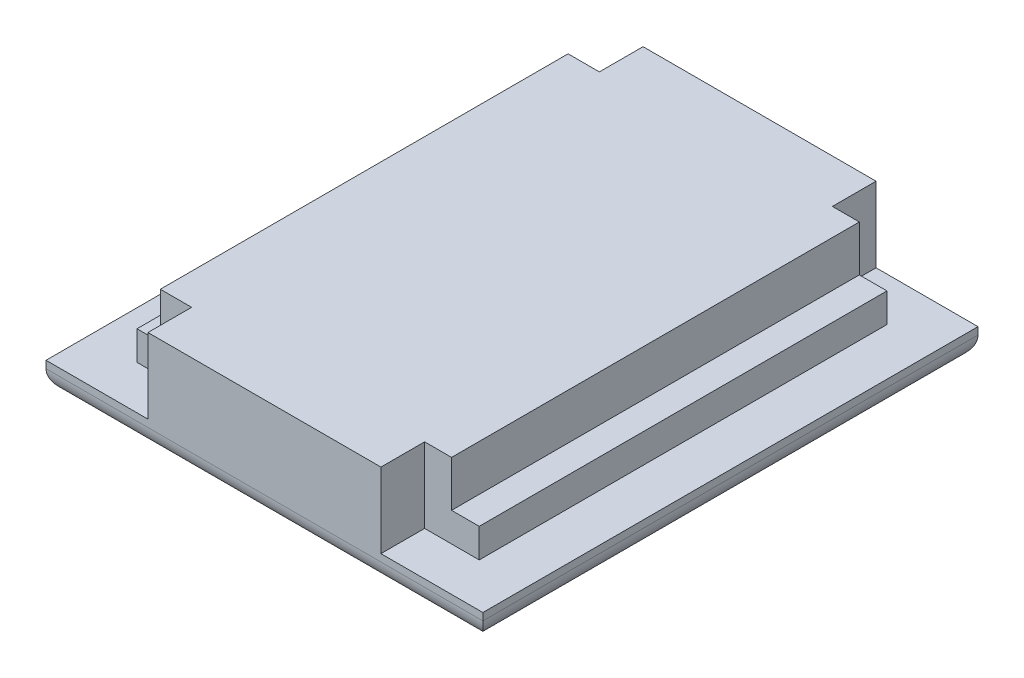
ISO-10303-21;
HEADER;
FILE_DESCRIPTION(('STEP AP214'),'2;1');
FILE_NAME('part.step','',(''),(''),'','','');
FILE_SCHEMA(('AUTOMOTIVE_DESIGN { 1 0 10303 214 1 1 1 1 }'));
ENDSEC;
DATA;
#1=APPLICATION_CONTEXT('core data for automotive mechanical design processes');
#2=APPLICATION_PROTOCOL_DEFINITION('international standard','automotive_design',2000,#1);
#3=PRODUCT_CONTEXT('',#1,'mechanical');
#4=PRODUCT('Part','Part','',(#3));
#5=PRODUCT_RELATED_PRODUCT_CATEGORY('part','',(#4));
#6=PRODUCT_DEFINITION_FORMATION('','',#4);
#7=PRODUCT_DEFINITION_CONTEXT('part definition',#1,'design');
#8=PRODUCT_DEFINITION('design','',#6,#7);
#9=PRODUCT_DEFINITION_SHAPE('','',#8);
#10=(LENGTH_UNIT() NAMED_UNIT(*) SI_UNIT(.MILLI.,.METRE.));
#11=(NAMED_UNIT(*) PLANE_ANGLE_UNIT() SI_UNIT($,.RADIAN.));
#12=(NAMED_UNIT(*) SI_UNIT($,.STERADIAN.) SOLID_ANGLE_UNIT());
#13=UNCERTAINTY_MEASURE_WITH_UNIT(LENGTH_MEASURE(1.E-05),#10,'distance_accuracy_value','');
#14=(GEOMETRIC_REPRESENTATION_CONTEXT(3) GLOBAL_UNCERTAINTY_ASSIGNED_CONTEXT((#13)) GLOBAL_UNIT_ASSIGNED_CONTEXT((#10,
#11,#12)) REPRESENTATION_CONTEXT('',''));
#15=CARTESIAN_POINT('',(0.,0.,0.));
#16=DIRECTION('',(0.,0.,1.));
#17=DIRECTION('',(1.,0.,0.));
#18=AXIS2_PLACEMENT_3D('',#15,#16,#17);
#19=CARTESIAN_POINT('',(0.,2.54,0.));
#20=DIRECTION('',(0.,1.,0.));
#21=DIRECTION('',(0.,0.,1.));
#22=AXIS2_PLACEMENT_3D('',#19,#20,#21);
#23=PLANE('',#22);
#24=DIRECTION('',(-1.,0.,0.));
#25=VECTOR('',#24,1.);
#26=CARTESIAN_POINT('',(-15.1389772727273,2.54,-7.48289772727273));
#27=LINE('',#26,#25);
#28=CARTESIAN_POINT('',(-10.3764772727273,2.54,-7.48289772727273));
#29=VERTEX_POINT('',#28);
#30=CARTESIAN_POINT('',(-15.1389772727273,2.54,-7.48289772727273));
#31=VERTEX_POINT('',#30);
#32=EDGE_CURVE('E298',#29,#31,#27,.T.);
#33=ORIENTED_EDGE('',*,*,#32,.F.);
#34=DIRECTION('',(0.,0.,1.));
#35=VECTOR('',#34,1.);
#36=CARTESIAN_POINT('',(-10.3764772727273,2.54,-11.2928977272727));
#37=LINE('',#36,#35);
#38=CARTESIAN_POINT('',(-10.3764772727273,2.54,-11.2928977272727));
#39=VERTEX_POINT('',#38);
#40=EDGE_CURVE('E219',#39,#29,#37,.T.);
#41=ORIENTED_EDGE('',*,*,#40,.F.);
#42=DIRECTION('',(-1.,0.,0.));
#43=VECTOR('',#42,1.);
#44=CARTESIAN_POINT('',(-19.2664772727273,2.54,-11.2928977272727));
#45=LINE('',#44,#43);
#46=CARTESIAN_POINT('',(-19.2664772727273,2.54,-11.2928977272727));
#47=VERTEX_POINT('',#46);
#48=EDGE_CURVE('E321',#39,#47,#45,.T.);
#49=ORIENTED_EDGE('',*,*,#48,.T.);
#50=DIRECTION('',(0.,0.,1.));
#51=VECTOR('',#50,1.);
#52=CARTESIAN_POINT('',(-19.2664772727273,2.54,-11.2928977272727));
#53=LINE('',#52,#51);
#54=CARTESIAN_POINT('',(-19.2664772727273,2.54,31.8871022727273));
#55=VERTEX_POINT('',#54);
#56=EDGE_CURVE('E312',#47,#55,#53,.T.);
#57=ORIENTED_EDGE('',*,*,#56,.T.);
#58=DIRECTION('',(1.,0.,0.));
#59=VECTOR('',#58,1.);
#60=CARTESIAN_POINT('',(-19.2664772727273,2.54,31.8871022727273));
#61=LINE('',#60,#59);
#62=CARTESIAN_POINT('',(-10.3764772727273,2.54,31.8871022727273));
#63=VERTEX_POINT('',#62);
#64=EDGE_CURVE('E316',#55,#63,#61,.T.);
#65=ORIENTED_EDGE('',*,*,#64,.T.);
#66=DIRECTION('',(0.,0.,1.));
#67=VECTOR('',#66,1.);
#68=CARTESIAN_POINT('',(-10.3764772727273,2.54,28.0771022727273));
#69=LINE('',#68,#67);
#70=CARTESIAN_POINT('',(-10.3764772727273,2.54,28.0771022727273));
#71=VERTEX_POINT('',#70);
#72=EDGE_CURVE('E215',#71,#63,#69,.T.);
#73=ORIENTED_EDGE('',*,*,#72,.F.);
#74=DIRECTION('',(1.,0.,0.));
#75=VECTOR('',#74,1.);
#76=CARTESIAN_POINT('',(-15.1389772727273,2.54,28.0771022727273));
#77=LINE('',#76,#75);
#78=CARTESIAN_POINT('',(-15.1389772727273,2.54,28.0771022727273));
#79=VERTEX_POINT('',#78);
#80=EDGE_CURVE('E292',#79,#71,#77,.T.);
#81=ORIENTED_EDGE('',*,*,#80,.F.);
#82=DIRECTION('',(0.,0.,1.));
#83=VECTOR('',#82,1.);
#84=CARTESIAN_POINT('',(-15.1389772727273,2.54,-7.48289772727273));
#85=LINE('',#84,#83);
#86=EDGE_CURVE('E275',#31,#79,#85,.T.);
#87=ORIENTED_EDGE('',*,*,#86,.F.);
#88=EDGE_LOOP('',(#33,#41,#49,#57,#65,#73,#81,#87));
#89=FACE_BOUND('',#88,.T.);
#90=ADVANCED_FACE('F37',(#89),#23,.T.);
#91=CARTESIAN_POINT('',(18.8335227272727,2.54,-11.2928977272727));
#92=VERTEX_POINT('',#91);
#93=CARTESIAN_POINT('',(9.94352272727273,2.54,-11.2928977272727));
#94=VERTEX_POINT('',#93);
#95=EDGE_CURVE('E322',#92,#94,#45,.T.);
#96=ORIENTED_EDGE('',*,*,#95,.T.);
#97=DIRECTION('',(0.,0.,-1.));
#98=VECTOR('',#97,1.);
#99=CARTESIAN_POINT('',(9.94352272727273,2.54,-11.2928977272727));
#100=LINE('',#99,#98);
#101=CARTESIAN_POINT('',(9.94352272727273,2.54,-7.48289772727273));
#102=VERTEX_POINT('',#101);
#103=EDGE_CURVE('E195',#102,#94,#100,.T.);
#104=ORIENTED_EDGE('',*,*,#103,.F.);
#105=CARTESIAN_POINT('',(14.7060227272727,2.54,-7.48289772727273));
#106=VERTEX_POINT('',#105);
#107=EDGE_CURVE('E280',#106,#102,#27,.T.);
#108=ORIENTED_EDGE('',*,*,#107,.F.);
#109=DIRECTION('',(0.,0.,-1.));
#110=VECTOR('',#109,1.);
#111=CARTESIAN_POINT('',(14.7060227272727,2.54,-7.48289772727273));
#112=LINE('',#111,#110);
#113=CARTESIAN_POINT('',(14.7060227272727,2.54,28.0771022727273));
#114=VERTEX_POINT('',#113);
#115=EDGE_CURVE('E295',#114,#106,#112,.T.);
#116=ORIENTED_EDGE('',*,*,#115,.F.);
#117=CARTESIAN_POINT('',(9.94352272727273,2.54,28.0771022727272));
#118=VERTEX_POINT('',#117);
#119=EDGE_CURVE('E291',#118,#114,#77,.T.);
#120=ORIENTED_EDGE('',*,*,#119,.F.);
#121=DIRECTION('',(0.,0.,-1.));
#122=VECTOR('',#121,1.);
#123=CARTESIAN_POINT('',(9.94352272727273,2.54,28.0771022727272));
#124=LINE('',#123,#122);
#125=CARTESIAN_POINT('',(9.94352272727273,2.54,31.8871022727273));
#126=VERTEX_POINT('',#125);
#127=EDGE_CURVE('E228',#126,#118,#124,.T.);
#128=ORIENTED_EDGE('',*,*,#127,.F.);
#129=CARTESIAN_POINT('',(18.8335227272727,2.54,31.8871022727273));
#130=VERTEX_POINT('',#129);
#131=EDGE_CURVE('E315',#126,#130,#61,.T.);
#132=ORIENTED_EDGE('',*,*,#131,.T.);
#133=DIRECTION('',(0.,0.,-1.));
#134=VECTOR('',#133,1.);
#135=CARTESIAN_POINT('',(18.8335227272727,2.54,-11.2928977272727));
#136=LINE('',#135,#134);
#137=EDGE_CURVE('E319',#130,#92,#136,.T.);
#138=ORIENTED_EDGE('',*,*,#137,.T.);
#139=EDGE_LOOP('',(#96,#104,#108,#116,#120,#128,#132,#138));
#140=FACE_BOUND('',#139,.T.);
#141=ADVANCED_FACE('F380',(#140),#23,.T.);
#142=CARTESIAN_POINT('',(-15.1389772727273,5.08,-7.48289772727273));
#143=DIRECTION('',(0.,0.,1.));
#144=DIRECTION('',(1.,0.,0.));
#145=AXIS2_PLACEMENT_3D('',#142,#143,#144);
#146=PLANE('',#145);
#147=DIRECTION('',(0.,-1.,0.));
#148=VECTOR('',#147,1.);
#149=CARTESIAN_POINT('',(-10.3764772727273,29.7541021570466,-7.48289772727273));
#150=LINE('',#149,#148);
#151=CARTESIAN_POINT('',(-10.3764772727273,9.08,-7.48289772727273));
#152=VERTEX_POINT('',#151);
#153=EDGE_CURVE('E222',#152,#29,#150,.T.);
#154=ORIENTED_EDGE('',*,*,#153,.T.);
#155=ORIENTED_EDGE('',*,*,#32,.T.);
#156=DIRECTION('',(0.,-1.,0.));
#157=VECTOR('',#156,1.);
#158=CARTESIAN_POINT('',(-15.1389772727273,5.08,-7.48289772727273));
#159=LINE('',#158,#157);
#160=CARTESIAN_POINT('',(-15.1389772727273,5.08,-7.48289772727273));
#161=VERTEX_POINT('',#160);
#162=EDGE_CURVE('E288',#161,#31,#159,.T.);
#163=ORIENTED_EDGE('',*,*,#162,.F.);
#164=DIRECTION('',(-1.,0.,0.));
#165=VECTOR('',#164,1.);
#166=CARTESIAN_POINT('',(-15.1389772727273,5.08,-7.48289772727273));
#167=LINE('',#166,#165);
#168=CARTESIAN_POINT('',(-13.1069772727273,5.08,-7.48289772727273));
#169=VERTEX_POINT('',#168);
#170=EDGE_CURVE('E285',#169,#161,#167,.T.);
#171=ORIENTED_EDGE('',*,*,#170,.F.);
#172=DIRECTION('',(0.,-1.,0.));
#173=VECTOR('',#172,1.);
#174=CARTESIAN_POINT('',(-13.1069772727273,9.08,-7.48289772727273));
#175=LINE('',#174,#173);
#176=CARTESIAN_POINT('',(-13.1069772727273,9.08,-7.48289772727273));
#177=VERTEX_POINT('',#176);
#178=EDGE_CURVE('E259',#177,#169,#175,.T.);
#179=ORIENTED_EDGE('',*,*,#178,.F.);
#180=DIRECTION('',(-1.,0.,0.));
#181=VECTOR('',#180,1.);
#182=CARTESIAN_POINT('',(-13.1069772727273,9.08,-7.48289772727273));
#183=LINE('',#182,#181);
#184=EDGE_CURVE('E257',#152,#177,#183,.T.);
#185=ORIENTED_EDGE('',*,*,#184,.F.);
#186=EDGE_LOOP('',(#154,#155,#163,#171,#179,#185));
#187=FACE_BOUND('',#186,.T.);
#188=ADVANCED_FACE('F419',(#187),#146,.F.);
#189=DIRECTION('',(0.,-1.,0.));
#190=VECTOR('',#189,1.);
#191=CARTESIAN_POINT('',(9.94352272727273,29.7541021570466,-7.48289772727273));
#192=LINE('',#191,#190);
#193=CARTESIAN_POINT('',(9.94352272727273,9.08,-7.48289772727273));
#194=VERTEX_POINT('',#193);
#195=EDGE_CURVE('E225',#194,#102,#192,.T.);
#196=ORIENTED_EDGE('',*,*,#195,.F.);
#197=CARTESIAN_POINT('',(12.2930227272727,9.08,-7.48289772727273));
#198=VERTEX_POINT('',#197);
#199=EDGE_CURVE('E212',#198,#194,#183,.T.);
#200=ORIENTED_EDGE('',*,*,#199,.F.);
#201=DIRECTION('',(0.,-1.,0.));
#202=VECTOR('',#201,1.);
#203=CARTESIAN_POINT('',(12.2930227272727,9.08,-7.48289772727273));
#204=LINE('',#203,#202);
#205=CARTESIAN_POINT('',(12.2930227272727,5.08,-7.48289772727273));
#206=VERTEX_POINT('',#205);
#207=EDGE_CURVE('E266',#198,#206,#204,.T.);
#208=ORIENTED_EDGE('',*,*,#207,.T.);
#209=CARTESIAN_POINT('',(14.7060227272727,5.08,-7.48289772727273));
#210=VERTEX_POINT('',#209);
#211=EDGE_CURVE('E286',#210,#206,#167,.T.);
#212=ORIENTED_EDGE('',*,*,#211,.F.);
#213=DIRECTION('',(0.,-1.,0.));
#214=VECTOR('',#213,1.);
#215=CARTESIAN_POINT('',(14.7060227272727,5.08,-7.48289772727273));
#216=LINE('',#215,#214);
#217=EDGE_CURVE('E303',#210,#106,#216,.T.);
#218=ORIENTED_EDGE('',*,*,#217,.T.);
#219=ORIENTED_EDGE('',*,*,#107,.T.);
#220=EDGE_LOOP('',(#196,#200,#208,#212,#218,#219));
#221=FACE_BOUND('',#220,.T.);
#222=ADVANCED_FACE('F588',(#221),#146,.F.);
#223=CARTESIAN_POINT('',(-15.1389772727273,5.08,28.0771022727273));
#224=DIRECTION('',(0.,0.,-1.));
#225=DIRECTION('',(-1.,0.,0.));
#226=AXIS2_PLACEMENT_3D('',#223,#224,#225);
#227=PLANE('',#226);
#228=DIRECTION('',(0.,-1.,0.));
#229=VECTOR('',#228,1.);
#230=CARTESIAN_POINT('',(-10.3764772727273,29.7541021570466,28.0771022727273));
#231=LINE('',#230,#229);
#232=CARTESIAN_POINT('',(-10.3764772727273,9.08,28.0771022727273));
#233=VERTEX_POINT('',#232);
#234=EDGE_CURVE('E213',#233,#71,#231,.T.);
#235=ORIENTED_EDGE('',*,*,#234,.F.);
#236=DIRECTION('',(1.,0.,0.));
#237=VECTOR('',#236,1.);
#238=CARTESIAN_POINT('',(-13.1069772727273,9.08,28.0771022727273));
#239=LINE('',#238,#237);
#240=CARTESIAN_POINT('',(-13.1069772727273,9.08,28.0771022727273));
#241=VERTEX_POINT('',#240);
#242=EDGE_CURVE('E252',#241,#233,#239,.T.);
#243=ORIENTED_EDGE('',*,*,#242,.F.);
#244=DIRECTION('',(0.,-1.,0.));
#245=VECTOR('',#244,1.);
#246=CARTESIAN_POINT('',(-13.1069772727273,9.08,28.0771022727273));
#247=LINE('',#246,#245);
#248=CARTESIAN_POINT('',(-13.1069772727273,5.08,28.0771022727273));
#249=VERTEX_POINT('',#248);
#250=EDGE_CURVE('E272',#241,#249,#247,.T.);
#251=ORIENTED_EDGE('',*,*,#250,.T.);
#252=DIRECTION('',(1.,0.,0.));
#253=VECTOR('',#252,1.);
#254=CARTESIAN_POINT('',(-15.1389772727273,5.08,28.0771022727273));
#255=LINE('',#254,#253);
#256=CARTESIAN_POINT('',(-15.1389772727273,5.08,28.0771022727273));
#257=VERTEX_POINT('',#256);
#258=EDGE_CURVE('E281',#257,#249,#255,.T.);
#259=ORIENTED_EDGE('',*,*,#258,.F.);
#260=DIRECTION('',(0.,-1.,0.));
#261=VECTOR('',#260,1.);
#262=CARTESIAN_POINT('',(-15.1389772727273,5.08,28.0771022727273));
#263=LINE('',#262,#261);
#264=EDGE_CURVE('E309',#257,#79,#263,.T.);
#265=ORIENTED_EDGE('',*,*,#264,.T.);
#266=ORIENTED_EDGE('',*,*,#80,.T.);
#267=EDGE_LOOP('',(#235,#243,#251,#259,#265,#266));
#268=FACE_BOUND('',#267,.T.);
#269=ADVANCED_FACE('F392',(#268),#227,.F.);
#270=DIRECTION('',(0.,-1.,0.));
#271=VECTOR('',#270,1.);
#272=CARTESIAN_POINT('',(9.94352272727273,29.7541021570466,28.0771022727272));
#273=LINE('',#272,#271);
#274=CARTESIAN_POINT('',(9.94352272727273,9.08,28.0771022727273));
#275=VERTEX_POINT('',#274);
#276=EDGE_CURVE('E230',#275,#118,#273,.T.);
#277=ORIENTED_EDGE('',*,*,#276,.T.);
#278=ORIENTED_EDGE('',*,*,#119,.T.);
#279=DIRECTION('',(0.,-1.,0.));
#280=VECTOR('',#279,1.);
#281=CARTESIAN_POINT('',(14.7060227272727,5.08,28.0771022727273));
#282=LINE('',#281,#280);
#283=CARTESIAN_POINT('',(14.7060227272727,5.08,28.0771022727273));
#284=VERTEX_POINT('',#283);
#285=EDGE_CURVE('E306',#284,#114,#282,.T.);
#286=ORIENTED_EDGE('',*,*,#285,.F.);
#287=CARTESIAN_POINT('',(12.2930227272727,5.08,28.0771022727273));
#288=VERTEX_POINT('',#287);
#289=EDGE_CURVE('E279',#288,#284,#255,.T.);
#290=ORIENTED_EDGE('',*,*,#289,.F.);
#291=DIRECTION('',(0.,-1.,0.));
#292=VECTOR('',#291,1.);
#293=CARTESIAN_POINT('',(12.2930227272727,9.08,28.0771022727273));
#294=LINE('',#293,#292);
#295=CARTESIAN_POINT('',(12.2930227272727,9.08,28.0771022727273));
#296=VERTEX_POINT('',#295);
#297=EDGE_CURVE('E269',#296,#288,#294,.T.);
#298=ORIENTED_EDGE('',*,*,#297,.F.);
#299=EDGE_CURVE('E250',#275,#296,#239,.T.);
#300=ORIENTED_EDGE('',*,*,#299,.F.);
#301=EDGE_LOOP('',(#277,#278,#286,#290,#298,#300));
#302=FACE_BOUND('',#301,.T.);
#303=ADVANCED_FACE('F409',(#302),#227,.F.);
#304=CARTESIAN_POINT('',(0.,5.08,0.));
#305=DIRECTION('',(0.,1.,0.));
#306=DIRECTION('',(0.,0.,1.));
#307=AXIS2_PLACEMENT_3D('',#304,#305,#306);
#308=PLANE('',#307);
#309=DIRECTION('',(0.,0.,1.));
#310=VECTOR('',#309,1.);
#311=CARTESIAN_POINT('',(-13.1069772727273,5.08,-7.48289772727273));
#312=LINE('',#311,#310);
#313=EDGE_CURVE('E237',#169,#249,#312,.T.);
#314=ORIENTED_EDGE('',*,*,#313,.F.);
#315=ORIENTED_EDGE('',*,*,#170,.T.);
#316=DIRECTION('',(0.,0.,1.));
#317=VECTOR('',#316,1.);
#318=CARTESIAN_POINT('',(-15.1389772727273,5.08,-7.48289772727273));
#319=LINE('',#318,#317);
#320=EDGE_CURVE('E276',#161,#257,#319,.T.);
#321=ORIENTED_EDGE('',*,*,#320,.T.);
#322=ORIENTED_EDGE('',*,*,#258,.T.);
#323=EDGE_LOOP('',(#314,#315,#321,#322));
#324=FACE_BOUND('',#323,.T.);
#325=ADVANCED_FACE('F402',(#324),#308,.T.);
#326=CARTESIAN_POINT('',(-19.2664772727273,2.54,-11.2928977272727));
#327=DIRECTION('',(1.,0.,0.));
#328=DIRECTION('',(0.,0.,-1.));
#329=AXIS2_PLACEMENT_3D('',#326,#327,#328);
#330=PLANE('',#329);
#331=DIRECTION('',(0.,-1.,0.));
#332=VECTOR('',#331,1.);
#333=CARTESIAN_POINT('',(-19.2664772727273,2.54,-11.2928977272727));
#334=LINE('',#333,#332);
#335=CARTESIAN_POINT('',(-19.2664772727273,1.905,-11.2928977272727));
#336=VERTEX_POINT('',#335);
#337=EDGE_CURVE('E324',#47,#336,#334,.T.);
#338=ORIENTED_EDGE('',*,*,#337,.T.);
#339=DIRECTION('',(0.,0.,1.));
#340=VECTOR('',#339,1.);
#341=CARTESIAN_POINT('',(-19.2664772727273,1.905,-11.2928977272727));
#342=LINE('',#341,#340);
#343=CARTESIAN_POINT('',(-19.2664772727273,1.905,31.8871022727273));
#344=VERTEX_POINT('',#343);
#345=EDGE_CURVE('E11',#336,#344,#342,.T.);
#346=ORIENTED_EDGE('',*,*,#345,.T.);
#347=DIRECTION('',(0.,-1.,0.));
#348=VECTOR('',#347,1.);
#349=CARTESIAN_POINT('',(-19.2664772727273,2.54,31.8871022727273));
#350=LINE('',#349,#348);
#351=EDGE_CURVE('E330',#55,#344,#350,.T.);
#352=ORIENTED_EDGE('',*,*,#351,.F.);
#353=ORIENTED_EDGE('',*,*,#56,.F.);
#354=EDGE_LOOP('',(#338,#346,#352,#353));
#355=FACE_BOUND('',#354,.T.);
#356=ADVANCED_FACE('F400',(#355),#330,.F.);
#357=CARTESIAN_POINT('',(-19.2664772727273,2.54,31.8871022727273));
#358=DIRECTION('',(0.,0.,-1.));
#359=DIRECTION('',(-1.,0.,0.));
#360=AXIS2_PLACEMENT_3D('',#357,#358,#359);
#361=PLANE('',#360);
#362=ORIENTED_EDGE('',*,*,#351,.T.);
#363=DIRECTION('',(1.,0.,0.));
#364=VECTOR('',#363,1.);
#365=CARTESIAN_POINT('',(-19.2664772727273,1.905,31.8871022727273));
#366=LINE('',#365,#364);
#367=CARTESIAN_POINT('',(18.8335227272727,1.905,31.8871022727273));
#368=VERTEX_POINT('',#367);
#369=EDGE_CURVE('E333',#344,#368,#366,.T.);
#370=ORIENTED_EDGE('',*,*,#369,.T.);
#371=DIRECTION('',(0.,-1.,0.));
#372=VECTOR('',#371,1.);
#373=CARTESIAN_POINT('',(18.8335227272727,2.54,31.8871022727273));
#374=LINE('',#373,#372);
#375=EDGE_CURVE('E328',#130,#368,#374,.T.);
#376=ORIENTED_EDGE('',*,*,#375,.F.);
#377=ORIENTED_EDGE('',*,*,#131,.F.);
#378=DIRECTION('',(0.,-1.,0.));
#379=VECTOR('',#378,1.);
#380=CARTESIAN_POINT('',(9.94352272727273,29.7541021570466,31.8871022727273));
#381=LINE('',#380,#379);
#382=CARTESIAN_POINT('',(9.94352272727273,9.08,31.8871022727273));
#383=VERTEX_POINT('',#382);
#384=EDGE_CURVE('E231',#383,#126,#381,.T.);
#385=ORIENTED_EDGE('',*,*,#384,.F.);
#386=DIRECTION('',(1.,0.,0.));
#387=VECTOR('',#386,1.);
#388=CARTESIAN_POINT('',(-10.3764772727273,9.08,31.8871022727273));
#389=LINE('',#388,#387);
#390=CARTESIAN_POINT('',(-10.3764772727273,9.08,31.8871022727273));
#391=VERTEX_POINT('',#390);
#392=EDGE_CURVE('E238',#391,#383,#389,.T.);
#393=ORIENTED_EDGE('',*,*,#392,.F.);
#394=DIRECTION('',(0.,-1.,0.));
#395=VECTOR('',#394,1.);
#396=CARTESIAN_POINT('',(-10.3764772727273,29.7541021570466,31.8871022727273));
#397=LINE('',#396,#395);
#398=EDGE_CURVE('E234',#391,#63,#397,.T.);
#399=ORIENTED_EDGE('',*,*,#398,.T.);
#400=ORIENTED_EDGE('',*,*,#64,.F.);
#401=EDGE_LOOP('',(#362,#370,#376,#377,#385,#393,#399,#400));
#402=FACE_BOUND('',#401,.T.);
#403=ADVANCED_FACE('F374',(#402),#361,.F.);
#404=CARTESIAN_POINT('',(18.8335227272727,2.54,-11.2928977272727));
#405=DIRECTION('',(-1.,0.,0.));
#406=DIRECTION('',(0.,0.,1.));
#407=AXIS2_PLACEMENT_3D('',#404,#405,#406);
#408=PLANE('',#407);
#409=ORIENTED_EDGE('',*,*,#375,.T.);
#410=DIRECTION('',(0.,0.,-1.));
#411=VECTOR('',#410,1.);
#412=CARTESIAN_POINT('',(18.8335227272727,1.905,-11.2928977272727));
#413=LINE('',#412,#411);
#414=CARTESIAN_POINT('',(18.8335227272727,1.905,-11.2928977272727));
#415=VERTEX_POINT('',#414);
#416=EDGE_CURVE('E61',#368,#415,#413,.T.);
#417=ORIENTED_EDGE('',*,*,#416,.T.);
#418=DIRECTION('',(0.,-1.,0.));
#419=VECTOR('',#418,1.);
#420=CARTESIAN_POINT('',(18.8335227272727,2.54,-11.2928977272727));
#421=LINE('',#420,#419);
#422=EDGE_CURVE('E326',#92,#415,#421,.T.);
#423=ORIENTED_EDGE('',*,*,#422,.F.);
#424=ORIENTED_EDGE('',*,*,#137,.F.);
#425=EDGE_LOOP('',(#409,#417,#423,#424));
#426=FACE_BOUND('',#425,.T.);
#427=ADVANCED_FACE('F378',(#426),#408,.F.);
#428=CARTESIAN_POINT('',(-19.2664772727273,2.54,-11.2928977272727));
#429=DIRECTION('',(0.,0.,1.));
#430=DIRECTION('',(1.,0.,0.));
#431=AXIS2_PLACEMENT_3D('',#428,#429,#430);
#432=PLANE('',#431);
#433=ORIENTED_EDGE('',*,*,#422,.T.);
#434=DIRECTION('',(-1.,0.,0.));
#435=VECTOR('',#434,1.);
#436=CARTESIAN_POINT('',(-19.2664772727273,1.905,-11.2928977272727));
#437=LINE('',#436,#435);
#438=EDGE_CURVE('E46',#415,#336,#437,.T.);
#439=ORIENTED_EDGE('',*,*,#438,.T.);
#440=ORIENTED_EDGE('',*,*,#337,.F.);
#441=ORIENTED_EDGE('',*,*,#48,.F.);
#442=DIRECTION('',(0.,-1.,0.));
#443=VECTOR('',#442,1.);
#444=CARTESIAN_POINT('',(-10.3764772727273,29.7541021570466,-11.2928977272727));
#445=LINE('',#444,#443);
#446=CARTESIAN_POINT('',(-10.3764772727273,9.08,-11.2928977272727));
#447=VERTEX_POINT('',#446);
#448=EDGE_CURVE('E203',#447,#39,#445,.T.);
#449=ORIENTED_EDGE('',*,*,#448,.F.);
#450=DIRECTION('',(-1.,0.,0.));
#451=VECTOR('',#450,1.);
#452=CARTESIAN_POINT('',(-10.3764772727273,9.08,-11.2928977272727));
#453=LINE('',#452,#451);
#454=CARTESIAN_POINT('',(9.94352272727273,9.08,-11.2928977272727));
#455=VERTEX_POINT('',#454);
#456=EDGE_CURVE('E198',#455,#447,#453,.T.);
#457=ORIENTED_EDGE('',*,*,#456,.F.);
#458=DIRECTION('',(0.,-1.,0.));
#459=VECTOR('',#458,1.);
#460=CARTESIAN_POINT('',(9.94352272727273,29.7541021570466,-11.2928977272727));
#461=LINE('',#460,#459);
#462=EDGE_CURVE('E188',#455,#94,#461,.T.);
#463=ORIENTED_EDGE('',*,*,#462,.T.);
#464=ORIENTED_EDGE('',*,*,#95,.F.);
#465=EDGE_LOOP('',(#433,#439,#440,#441,#449,#457,#463,#464));
#466=FACE_BOUND('',#465,.T.);
#467=ADVANCED_FACE('F201',(#466),#432,.F.);
#468=CARTESIAN_POINT('',(0.,0.,0.));
#469=DIRECTION('',(0.,1.,0.));
#470=DIRECTION('',(0.,0.,1.));
#471=AXIS2_PLACEMENT_3D('',#468,#469,#470);
#472=PLANE('',#471);
#473=DIRECTION('',(0.,0.,-1.));
#474=VECTOR('',#473,1.);
#475=CARTESIAN_POINT('',(16.9285227272727,0.,0.));
#476=LINE('',#475,#474);
#477=CARTESIAN_POINT('',(16.9285227272727,0.,-9.38789772727273));
#478=VERTEX_POINT('',#477);
#479=CARTESIAN_POINT('',(16.9285227272727,0.,29.9821022727273));
#480=VERTEX_POINT('',#479);
#481=EDGE_CURVE('E340',#478,#480,#476,.F.);
#482=ORIENTED_EDGE('',*,*,#481,.T.);
#483=DIRECTION('',(1.,0.,0.));
#484=VECTOR('',#483,1.);
#485=CARTESIAN_POINT('',(0.,0.,29.9821022727273));
#486=LINE('',#485,#484);
#487=CARTESIAN_POINT('',(-17.3614772727273,0.,29.9821022727273));
#488=VERTEX_POINT('',#487);
#489=EDGE_CURVE('E342',#480,#488,#486,.F.);
#490=ORIENTED_EDGE('',*,*,#489,.T.);
#491=DIRECTION('',(0.,0.,1.));
#492=VECTOR('',#491,1.);
#493=CARTESIAN_POINT('',(-17.3614772727273,0.,0.));
#494=LINE('',#493,#492);
#495=CARTESIAN_POINT('',(-17.3614772727273,0.,-9.38789772727273));
#496=VERTEX_POINT('',#495);
#497=EDGE_CURVE('E336',#488,#496,#494,.F.);
#498=ORIENTED_EDGE('',*,*,#497,.T.);
#499=DIRECTION('',(-1.,0.,0.));
#500=VECTOR('',#499,1.);
#501=CARTESIAN_POINT('',(0.,0.,-9.38789772727273));
#502=LINE('',#501,#500);
#503=EDGE_CURVE('E338',#496,#478,#502,.F.);
#504=ORIENTED_EDGE('',*,*,#503,.T.);
#505=EDGE_LOOP('',(#482,#490,#498,#504));
#506=FACE_BOUND('',#505,.T.);
#507=ADVANCED_FACE('F365',(#506),#472,.F.);
#508=CARTESIAN_POINT('',(-15.1389772727273,5.08,-7.48289772727273));
#509=DIRECTION('',(1.,0.,0.));
#510=DIRECTION('',(0.,0.,-1.));
#511=AXIS2_PLACEMENT_3D('',#508,#509,#510);
#512=PLANE('',#511);
#513=ORIENTED_EDGE('',*,*,#86,.T.);
#514=ORIENTED_EDGE('',*,*,#264,.F.);
#515=ORIENTED_EDGE('',*,*,#320,.F.);
#516=ORIENTED_EDGE('',*,*,#162,.T.);
#517=EDGE_LOOP('',(#513,#514,#515,#516));
#518=FACE_BOUND('',#517,.T.);
#519=ADVANCED_FACE('F422',(#518),#512,.F.);
#520=CARTESIAN_POINT('',(14.7060227272727,5.08,-7.48289772727273));
#521=DIRECTION('',(-1.,0.,0.));
#522=DIRECTION('',(0.,0.,1.));
#523=AXIS2_PLACEMENT_3D('',#520,#521,#522);
#524=PLANE('',#523);
#525=ORIENTED_EDGE('',*,*,#115,.T.);
#526=ORIENTED_EDGE('',*,*,#217,.F.);
#527=DIRECTION('',(0.,0.,-1.));
#528=VECTOR('',#527,1.);
#529=CARTESIAN_POINT('',(14.7060227272727,5.08,-7.48289772727273));
#530=LINE('',#529,#528);
#531=EDGE_CURVE('E283',#284,#210,#530,.T.);
#532=ORIENTED_EDGE('',*,*,#531,.F.);
#533=ORIENTED_EDGE('',*,*,#285,.T.);
#534=EDGE_LOOP('',(#525,#526,#532,#533));
#535=FACE_BOUND('',#534,.T.);
#536=ADVANCED_FACE('F448',(#535),#524,.F.);
#537=DIRECTION('',(0.,0.,-1.));
#538=VECTOR('',#537,1.);
#539=CARTESIAN_POINT('',(12.2930227272727,5.08,-7.48289772727273));
#540=LINE('',#539,#538);
#541=EDGE_CURVE('E251',#288,#206,#540,.T.);
#542=ORIENTED_EDGE('',*,*,#541,.F.);
#543=ORIENTED_EDGE('',*,*,#289,.T.);
#544=ORIENTED_EDGE('',*,*,#531,.T.);
#545=ORIENTED_EDGE('',*,*,#211,.T.);
#546=EDGE_LOOP('',(#542,#543,#544,#545));
#547=FACE_BOUND('',#546,.T.);
#548=ADVANCED_FACE('F412',(#547),#308,.T.);
#549=CARTESIAN_POINT('',(-13.1069772727273,9.08,-7.48289772727273));
#550=DIRECTION('',(1.,0.,0.));
#551=DIRECTION('',(0.,0.,-1.));
#552=AXIS2_PLACEMENT_3D('',#549,#550,#551);
#553=PLANE('',#552);
#554=ORIENTED_EDGE('',*,*,#313,.T.);
#555=ORIENTED_EDGE('',*,*,#250,.F.);
#556=DIRECTION('',(0.,0.,1.));
#557=VECTOR('',#556,1.);
#558=CARTESIAN_POINT('',(-13.1069772727273,9.08,-7.48289772727273));
#559=LINE('',#558,#557);
#560=EDGE_CURVE('E248',#177,#241,#559,.T.);
#561=ORIENTED_EDGE('',*,*,#560,.F.);
#562=ORIENTED_EDGE('',*,*,#178,.T.);
#563=EDGE_LOOP('',(#554,#555,#561,#562));
#564=FACE_BOUND('',#563,.T.);
#565=ADVANCED_FACE('F463',(#564),#553,.F.);
#566=CARTESIAN_POINT('',(12.2930227272727,9.08,-7.48289772727273));
#567=DIRECTION('',(-1.,0.,0.));
#568=DIRECTION('',(0.,0.,1.));
#569=AXIS2_PLACEMENT_3D('',#566,#567,#568);
#570=PLANE('',#569);
#571=ORIENTED_EDGE('',*,*,#541,.T.);
#572=ORIENTED_EDGE('',*,*,#207,.F.);
#573=DIRECTION('',(0.,0.,-1.));
#574=VECTOR('',#573,1.);
#575=CARTESIAN_POINT('',(12.2930227272727,9.08,-7.48289772727273));
#576=LINE('',#575,#574);
#577=EDGE_CURVE('E255',#296,#198,#576,.T.);
#578=ORIENTED_EDGE('',*,*,#577,.F.);
#579=ORIENTED_EDGE('',*,*,#297,.T.);
#580=EDGE_LOOP('',(#571,#572,#578,#579));
#581=FACE_BOUND('',#580,.T.);
#582=ADVANCED_FACE('F470',(#581),#570,.F.);
#583=CARTESIAN_POINT('',(0.,9.08,0.));
#584=DIRECTION('',(0.,1.,0.));
#585=DIRECTION('',(0.,0.,1.));
#586=AXIS2_PLACEMENT_3D('',#583,#584,#585);
#587=PLANE('',#586);
#588=ORIENTED_EDGE('',*,*,#560,.T.);
#589=ORIENTED_EDGE('',*,*,#242,.T.);
#590=DIRECTION('',(0.,0.,1.));
#591=VECTOR('',#590,1.);
#592=CARTESIAN_POINT('',(-10.3764772727273,9.08,28.0771022727273));
#593=LINE('',#592,#591);
#594=EDGE_CURVE('E241',#233,#391,#593,.T.);
#595=ORIENTED_EDGE('',*,*,#594,.T.);
#596=ORIENTED_EDGE('',*,*,#392,.T.);
#597=DIRECTION('',(0.,0.,-1.));
#598=VECTOR('',#597,1.);
#599=CARTESIAN_POINT('',(9.94352272727273,9.08,28.0771022727272));
#600=LINE('',#599,#598);
#601=EDGE_CURVE('E235',#383,#275,#600,.T.);
#602=ORIENTED_EDGE('',*,*,#601,.T.);
#603=ORIENTED_EDGE('',*,*,#299,.T.);
#604=ORIENTED_EDGE('',*,*,#577,.T.);
#605=ORIENTED_EDGE('',*,*,#199,.T.);
#606=DIRECTION('',(0.,0.,-1.));
#607=VECTOR('',#606,1.);
#608=CARTESIAN_POINT('',(9.94352272727273,9.08,-11.2928977272727));
#609=LINE('',#608,#607);
#610=EDGE_CURVE('E192',#194,#455,#609,.T.);
#611=ORIENTED_EDGE('',*,*,#610,.T.);
#612=ORIENTED_EDGE('',*,*,#456,.T.);
#613=DIRECTION('',(0.,0.,1.));
#614=VECTOR('',#613,1.);
#615=CARTESIAN_POINT('',(-10.3764772727273,9.08,-11.2928977272727));
#616=LINE('',#615,#614);
#617=EDGE_CURVE('E206',#447,#152,#616,.T.);
#618=ORIENTED_EDGE('',*,*,#617,.T.);
#619=ORIENTED_EDGE('',*,*,#184,.T.);
#620=EDGE_LOOP('',(#588,#589,#595,#596,#602,#603,#604,#605,#611,#612,#618,#619));
#621=FACE_BOUND('',#620,.T.);
#622=ADVANCED_FACE('F210',(#621),#587,.T.);
#623=CARTESIAN_POINT('',(-10.3764772727273,29.7541021570466,28.0771022727273));
#624=DIRECTION('',(1.,0.,0.));
#625=DIRECTION('',(0.,0.,-1.));
#626=AXIS2_PLACEMENT_3D('',#623,#624,#625);
#627=PLANE('',#626);
#628=ORIENTED_EDGE('',*,*,#594,.F.);
#629=ORIENTED_EDGE('',*,*,#234,.T.);
#630=ORIENTED_EDGE('',*,*,#72,.T.);
#631=ORIENTED_EDGE('',*,*,#398,.F.);
#632=EDGE_LOOP('',(#628,#629,#630,#631));
#633=FACE_BOUND('',#632,.T.);
#634=ADVANCED_FACE('F389',(#633),#627,.F.);
#635=CARTESIAN_POINT('',(9.94352272727273,29.7541021570466,28.0771022727272));
#636=DIRECTION('',(-1.,0.,0.));
#637=DIRECTION('',(0.,0.,1.));
#638=AXIS2_PLACEMENT_3D('',#635,#636,#637);
#639=PLANE('',#638);
#640=ORIENTED_EDGE('',*,*,#601,.F.);
#641=ORIENTED_EDGE('',*,*,#384,.T.);
#642=ORIENTED_EDGE('',*,*,#127,.T.);
#643=ORIENTED_EDGE('',*,*,#276,.F.);
#644=EDGE_LOOP('',(#640,#641,#642,#643));
#645=FACE_BOUND('',#644,.T.);
#646=ADVANCED_FACE('F492',(#645),#639,.F.);
#647=CARTESIAN_POINT('',(-10.3764772727273,29.7541021570466,-11.2928977272727));
#648=DIRECTION('',(1.,0.,0.));
#649=DIRECTION('',(0.,0.,-1.));
#650=AXIS2_PLACEMENT_3D('',#647,#648,#649);
#651=PLANE('',#650);
#652=ORIENTED_EDGE('',*,*,#617,.F.);
#653=ORIENTED_EDGE('',*,*,#448,.T.);
#654=ORIENTED_EDGE('',*,*,#40,.T.);
#655=ORIENTED_EDGE('',*,*,#153,.F.);
#656=EDGE_LOOP('',(#652,#653,#654,#655));
#657=FACE_BOUND('',#656,.T.);
#658=ADVANCED_FACE('F499',(#657),#651,.F.);
#659=CARTESIAN_POINT('',(9.94352272727273,29.7541021570466,-11.2928977272727));
#660=DIRECTION('',(-1.,0.,0.));
#661=DIRECTION('',(0.,0.,1.));
#662=AXIS2_PLACEMENT_3D('',#659,#660,#661);
#663=PLANE('',#662);
#664=ORIENTED_EDGE('',*,*,#610,.F.);
#665=ORIENTED_EDGE('',*,*,#195,.T.);
#666=ORIENTED_EDGE('',*,*,#103,.T.);
#667=ORIENTED_EDGE('',*,*,#462,.F.);
#668=EDGE_LOOP('',(#664,#665,#666,#667));
#669=FACE_BOUND('',#668,.T.);
#670=ADVANCED_FACE('F190',(#669),#663,.F.);
#671=CARTESIAN_POINT('',(-19.2664772727273,1.905,-9.38789772727273));
#672=DIRECTION('',(-1.,0.,0.));
#673=DIRECTION('',(0.,0.,1.));
#674=AXIS2_PLACEMENT_3D('',#671,#672,#673);
#675=CYLINDRICAL_SURFACE('',#674,1.905);
#676=CARTESIAN_POINT('',(16.9285227272727,1.905,-9.38789772727273));
#677=DIRECTION('',(-0.707106781186548,0.,-0.707106781186547));
#678=DIRECTION('',(-0.707106781186547,0.,0.707106781186548));
#679=AXIS2_PLACEMENT_3D('',#676,#677,#678);
#680=ELLIPSE('',#679,2.69407683632075,1.905);
#681=EDGE_CURVE('E350',#478,#415,#680,.F.);
#682=ORIENTED_EDGE('',*,*,#681,.F.);
#683=ORIENTED_EDGE('',*,*,#503,.F.);
#684=CARTESIAN_POINT('',(-17.3614772727273,1.905,-9.38789772727273));
#685=DIRECTION('',(-0.707106781186547,0.,0.707106781186548));
#686=DIRECTION('',(0.707106781186547,0.,0.707106781186547));
#687=AXIS2_PLACEMENT_3D('',#684,#685,#686);
#688=ELLIPSE('',#687,2.69407683632075,1.905);
#689=EDGE_CURVE('E41',#336,#496,#688,.T.);
#690=ORIENTED_EDGE('',*,*,#689,.F.);
#691=ORIENTED_EDGE('',*,*,#438,.F.);
#692=EDGE_LOOP('',(#682,#683,#690,#691));
#693=FACE_BOUND('',#692,.T.);
#694=ADVANCED_FACE('F39',(#693),#675,.T.);
#695=CARTESIAN_POINT('',(-17.3614772727273,1.905,-11.2928977272727));
#696=DIRECTION('',(0.,0.,1.));
#697=DIRECTION('',(1.,0.,0.));
#698=AXIS2_PLACEMENT_3D('',#695,#696,#697);
#699=CYLINDRICAL_SURFACE('',#698,1.905);
#700=ORIENTED_EDGE('',*,*,#689,.T.);
#701=ORIENTED_EDGE('',*,*,#497,.F.);
#702=CARTESIAN_POINT('',(-17.3614772727273,1.905,29.9821022727273));
#703=DIRECTION('',(0.707106781186547,0.,0.707106781186547));
#704=DIRECTION('',(-0.707106781186547,0.,0.707106781186548));
#705=AXIS2_PLACEMENT_3D('',#702,#703,#704);
#706=ELLIPSE('',#705,2.69407683632075,1.905);
#707=EDGE_CURVE('E349',#344,#488,#706,.T.);
#708=ORIENTED_EDGE('',*,*,#707,.F.);
#709=ORIENTED_EDGE('',*,*,#345,.F.);
#710=EDGE_LOOP('',(#700,#701,#708,#709));
#711=FACE_BOUND('',#710,.T.);
#712=ADVANCED_FACE('F360',(#711),#699,.T.);
#713=CARTESIAN_POINT('',(16.9285227272727,1.905,-11.2928977272727));
#714=DIRECTION('',(0.,0.,-1.));
#715=DIRECTION('',(-1.,0.,0.));
#716=AXIS2_PLACEMENT_3D('',#713,#714,#715);
#717=CYLINDRICAL_SURFACE('',#716,1.905);
#718=ORIENTED_EDGE('',*,*,#681,.T.);
#719=ORIENTED_EDGE('',*,*,#416,.F.);
#720=CARTESIAN_POINT('',(16.9285227272727,1.905,29.9821022727273));
#721=DIRECTION('',(0.707106781186547,0.,-0.707106781186548));
#722=DIRECTION('',(-0.707106781186548,0.,-0.707106781186547));
#723=AXIS2_PLACEMENT_3D('',#720,#721,#722);
#724=ELLIPSE('',#723,2.69407683632075,1.905);
#725=EDGE_CURVE('E347',#480,#368,#724,.F.);
#726=ORIENTED_EDGE('',*,*,#725,.F.);
#727=ORIENTED_EDGE('',*,*,#481,.F.);
#728=EDGE_LOOP('',(#718,#719,#726,#727));
#729=FACE_BOUND('',#728,.T.);
#730=ADVANCED_FACE('F371',(#729),#717,.T.);
#731=CARTESIAN_POINT('',(-19.2664772727273,1.905,29.9821022727273));
#732=DIRECTION('',(1.,0.,0.));
#733=DIRECTION('',(0.,0.,-1.));
#734=AXIS2_PLACEMENT_3D('',#731,#732,#733);
#735=CYLINDRICAL_SURFACE('',#734,1.905);
#736=ORIENTED_EDGE('',*,*,#707,.T.);
#737=ORIENTED_EDGE('',*,*,#489,.F.);
#738=ORIENTED_EDGE('',*,*,#725,.T.);
#739=ORIENTED_EDGE('',*,*,#369,.F.);
#740=EDGE_LOOP('',(#736,#737,#738,#739));
#741=FACE_BOUND('',#740,.T.);
#742=ADVANCED_FACE('F369',(#741),#735,.T.);
#743=CLOSED_SHELL('',(#90,#141,#188,#222,#269,#303,#325,#356,#403,#427,#467,#507,#519,#536,#548,
#565,#582,#622,#634,#646,#658,#670,#694,#712,#730,#742));
#744=MANIFOLD_SOLID_BREP('B2',#743);
#745=ADVANCED_BREP_SHAPE_REPRESENTATION('',(#18,#744),#14);
#746=SHAPE_DEFINITION_REPRESENTATION(#9,#745);
ENDSEC;
END-ISO-10303-21;
